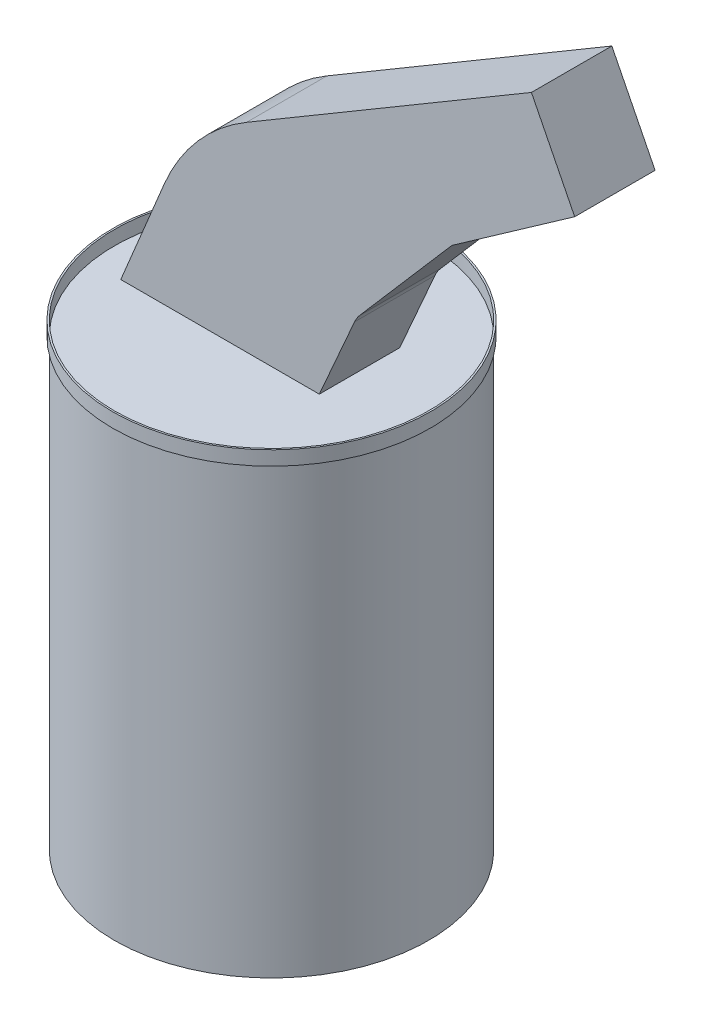
ISO-10303-21;
HEADER;
FILE_DESCRIPTION(('STEP AP214'),'2;1');
FILE_NAME('part.step','',(''),(''),'','','');
FILE_SCHEMA(('AUTOMOTIVE_DESIGN { 1 0 10303 214 1 1 1 1 }'));
ENDSEC;
DATA;
#1=APPLICATION_CONTEXT('core data for automotive mechanical design processes');
#2=APPLICATION_PROTOCOL_DEFINITION('international standard','automotive_design',2000,#1);
#3=PRODUCT_CONTEXT('',#1,'mechanical');
#4=PRODUCT('Part','Part','',(#3));
#5=PRODUCT_RELATED_PRODUCT_CATEGORY('part','',(#4));
#6=PRODUCT_DEFINITION_FORMATION('','',#4);
#7=PRODUCT_DEFINITION_CONTEXT('part definition',#1,'design');
#8=PRODUCT_DEFINITION('design','',#6,#7);
#9=PRODUCT_DEFINITION_SHAPE('','',#8);
#10=(LENGTH_UNIT() NAMED_UNIT(*) SI_UNIT(.MILLI.,.METRE.));
#11=(NAMED_UNIT(*) PLANE_ANGLE_UNIT() SI_UNIT($,.RADIAN.));
#12=(NAMED_UNIT(*) SI_UNIT($,.STERADIAN.) SOLID_ANGLE_UNIT());
#13=UNCERTAINTY_MEASURE_WITH_UNIT(LENGTH_MEASURE(1.E-05),#10,'distance_accuracy_value','');
#14=(GEOMETRIC_REPRESENTATION_CONTEXT(3) GLOBAL_UNCERTAINTY_ASSIGNED_CONTEXT((#13)) GLOBAL_UNIT_ASSIGNED_CONTEXT((#10,
#11,#12)) REPRESENTATION_CONTEXT('',''));
#15=CARTESIAN_POINT('',(0.,0.,0.));
#16=DIRECTION('',(0.,0.,1.));
#17=DIRECTION('',(1.,0.,0.));
#18=AXIS2_PLACEMENT_3D('',#15,#16,#17);
#19=CARTESIAN_POINT('',(46.4026965544984,91.6790408712856,12.15));
#20=DIRECTION('',(0.,0.,-1.));
#21=DIRECTION('',(-1.,0.,0.));
#22=AXIS2_PLACEMENT_3D('',#19,#20,#21);
#23=CYLINDRICAL_SURFACE('',#22,10.);
#24=CARTESIAN_POINT('',(46.4026965544984,91.6790408712856,-12.15));
#25=DIRECTION('',(0.,0.,-1.));
#26=DIRECTION('',(-1.,0.,0.));
#27=AXIS2_PLACEMENT_3D('',#24,#25,#26);
#28=CIRCLE('',#27,10.);
#29=CARTESIAN_POINT('',(37.2467300369342,95.7000204943678,-12.15));
#30=VERTEX_POINT('',#29);
#31=CARTESIAN_POINT('',(38.8362272029397,98.2172777553333,-12.15));
#32=VERTEX_POINT('',#31);
#33=EDGE_CURVE('E148',#30,#32,#28,.T.);
#34=ORIENTED_EDGE('',*,*,#33,.T.);
#35=DIRECTION('',(0.,0.,-1.));
#36=VECTOR('',#35,1.);
#37=CARTESIAN_POINT('',(38.8362272029397,98.2172777553333,12.15));
#38=LINE('',#37,#36);
#39=CARTESIAN_POINT('',(38.8362272029397,98.2172777553333,12.15));
#40=VERTEX_POINT('',#39);
#41=EDGE_CURVE('E12',#40,#32,#38,.T.);
#42=ORIENTED_EDGE('',*,*,#41,.F.);
#43=CARTESIAN_POINT('',(46.4026965544984,91.6790408712856,12.15));
#44=DIRECTION('',(0.,0.,-1.));
#45=DIRECTION('',(-1.,0.,0.));
#46=AXIS2_PLACEMENT_3D('',#43,#44,#45);
#47=CIRCLE('',#46,10.);
#48=CARTESIAN_POINT('',(37.2467300369342,95.7000204943678,12.15));
#49=VERTEX_POINT('',#48);
#50=EDGE_CURVE('E164',#49,#40,#47,.T.);
#51=ORIENTED_EDGE('',*,*,#50,.F.);
#52=DIRECTION('',(0.,0.,-1.));
#53=VECTOR('',#52,1.);
#54=CARTESIAN_POINT('',(37.2467300369342,95.7000204943678,12.15));
#55=LINE('',#54,#53);
#56=EDGE_CURVE('E144',#49,#30,#55,.T.);
#57=ORIENTED_EDGE('',*,*,#56,.T.);
#58=EDGE_LOOP('',(#34,#42,#51,#57));
#59=FACE_BOUND('',#58,.T.);
#60=ADVANCED_FACE('F46',(#59),#23,.F.);
#61=CARTESIAN_POINT('',(66.6539817342171,130.409777174197,12.15));
#62=DIRECTION('',(-0.756646935155878,0.653823688404769,0.));
#63=DIRECTION('',(-0.65382368840477,-0.756646935155878,0.));
#64=AXIS2_PLACEMENT_3D('',#61,#62,#63);
#65=PLANE('',#64);
#66=DIRECTION('',(0.653823688404769,0.756646935155878,0.));
#67=VECTOR('',#66,1.);
#68=CARTESIAN_POINT('',(66.6539817342171,130.409777174197,-12.15));
#69=LINE('',#68,#67);
#70=CARTESIAN_POINT('',(66.6539817342171,130.409777174197,-12.15));
#71=VERTEX_POINT('',#70);
#72=EDGE_CURVE('E151',#32,#71,#69,.T.);
#73=ORIENTED_EDGE('',*,*,#72,.T.);
#74=DIRECTION('',(0.,0.,-1.));
#75=VECTOR('',#74,1.);
#76=CARTESIAN_POINT('',(66.6539817342171,130.409777174197,12.15));
#77=LINE('',#76,#75);
#78=CARTESIAN_POINT('',(66.6539817342171,130.409777174197,12.15));
#79=VERTEX_POINT('',#78);
#80=EDGE_CURVE('E54',#79,#71,#77,.T.);
#81=ORIENTED_EDGE('',*,*,#80,.F.);
#82=DIRECTION('',(0.653823688404769,0.756646935155878,0.));
#83=VECTOR('',#82,1.);
#84=CARTESIAN_POINT('',(66.6539817342171,130.409777174197,12.15));
#85=LINE('',#84,#83);
#86=EDGE_CURVE('E108',#40,#79,#85,.T.);
#87=ORIENTED_EDGE('',*,*,#86,.F.);
#88=ORIENTED_EDGE('',*,*,#41,.T.);
#89=EDGE_LOOP('',(#73,#81,#87,#88));
#90=FACE_BOUND('',#89,.T.);
#91=ADVANCED_FACE('F207',(#90),#65,.F.);
#92=CARTESIAN_POINT('',(66.6539817342171,130.409777174197,12.15));
#93=DIRECTION('',(-0.574569426838052,0.818455847155479,0.));
#94=DIRECTION('',(-0.818455847155479,-0.574569426838052,0.));
#95=AXIS2_PLACEMENT_3D('',#92,#93,#94);
#96=PLANE('',#95);
#97=DIRECTION('',(0.818455847155479,0.574569426838052,0.));
#98=VECTOR('',#97,1.);
#99=CARTESIAN_POINT('',(66.6539817342171,130.409777174197,-12.15));
#100=LINE('',#99,#98);
#101=CARTESIAN_POINT('',(103.774602702842,156.469061847819,-12.15));
#102=VERTEX_POINT('',#101);
#103=EDGE_CURVE('E153',#71,#102,#100,.T.);
#104=ORIENTED_EDGE('',*,*,#103,.T.);
#105=DIRECTION('',(0.,0.,-1.));
#106=VECTOR('',#105,1.);
#107=CARTESIAN_POINT('',(103.774602702842,156.469061847819,12.15));
#108=LINE('',#107,#106);
#109=CARTESIAN_POINT('',(103.774602702842,156.469061847819,12.15));
#110=VERTEX_POINT('',#109);
#111=EDGE_CURVE('E174',#110,#102,#108,.T.);
#112=ORIENTED_EDGE('',*,*,#111,.F.);
#113=DIRECTION('',(0.818455847155479,0.574569426838052,0.));
#114=VECTOR('',#113,1.);
#115=CARTESIAN_POINT('',(66.6539817342171,130.409777174197,12.15));
#116=LINE('',#115,#114);
#117=EDGE_CURVE('E182',#79,#110,#116,.T.);
#118=ORIENTED_EDGE('',*,*,#117,.F.);
#119=ORIENTED_EDGE('',*,*,#80,.T.);
#120=EDGE_LOOP('',(#104,#112,#118,#119));
#121=FACE_BOUND('',#120,.T.);
#122=ADVANCED_FACE('F180',(#121),#96,.F.);
#123=CARTESIAN_POINT('',(103.774602702842,156.469061847819,12.15));
#124=DIRECTION('',(-0.893508762292376,-0.449045756807417,0.));
#125=DIRECTION('',(0.449045756807417,-0.893508762292376,0.));
#126=AXIS2_PLACEMENT_3D('',#123,#124,#125);
#127=PLANE('',#126);
#128=DIRECTION('',(-0.449045756807417,0.893508762292376,0.));
#129=VECTOR('',#128,1.);
#130=CARTESIAN_POINT('',(103.774602702842,156.469061847819,-12.15));
#131=LINE('',#130,#129);
#132=CARTESIAN_POINT('',(90.7045045958926,182.475870743217,-12.15));
#133=VERTEX_POINT('',#132);
#134=EDGE_CURVE('E155',#102,#133,#131,.T.);
#135=ORIENTED_EDGE('',*,*,#134,.T.);
#136=DIRECTION('',(0.,0.,-1.));
#137=VECTOR('',#136,1.);
#138=CARTESIAN_POINT('',(90.7045045958926,182.475870743217,12.15));
#139=LINE('',#138,#137);
#140=CARTESIAN_POINT('',(90.7045045958926,182.475870743217,12.15));
#141=VERTEX_POINT('',#140);
#142=EDGE_CURVE('E171',#141,#133,#139,.T.);
#143=ORIENTED_EDGE('',*,*,#142,.F.);
#144=DIRECTION('',(-0.449045756807417,0.893508762292376,0.));
#145=VECTOR('',#144,1.);
#146=CARTESIAN_POINT('',(103.774602702842,156.469061847819,12.15));
#147=LINE('',#146,#145);
#148=EDGE_CURVE('E198',#110,#141,#147,.T.);
#149=ORIENTED_EDGE('',*,*,#148,.F.);
#150=ORIENTED_EDGE('',*,*,#111,.T.);
#151=EDGE_LOOP('',(#135,#143,#149,#150));
#152=FACE_BOUND('',#151,.T.);
#153=ADVANCED_FACE('F191',(#152),#127,.F.);
#154=CARTESIAN_POINT('',(90.7045045958926,182.475870743217,12.15));
#155=DIRECTION('',(0.508666245283803,-0.86096379186867,0.));
#156=DIRECTION('',(0.86096379186867,0.508666245283803,0.));
#157=AXIS2_PLACEMENT_3D('',#154,#155,#156);
#158=PLANE('',#157);
#159=DIRECTION('',(-0.86096379186867,-0.508666245283803,0.));
#160=VECTOR('',#159,1.);
#161=CARTESIAN_POINT('',(90.7045045958926,182.475870743217,-12.15));
#162=LINE('',#161,#160);
#163=CARTESIAN_POINT('',(4.60812540902562,131.609246214837,-12.15));
#164=VERTEX_POINT('',#163);
#165=EDGE_CURVE('E157',#133,#164,#162,.T.);
#166=ORIENTED_EDGE('',*,*,#165,.T.);
#167=DIRECTION('',(0.,0.,-1.));
#168=VECTOR('',#167,1.);
#169=CARTESIAN_POINT('',(4.60812540902562,131.609246214837,12.15));
#170=LINE('',#169,#168);
#171=CARTESIAN_POINT('',(4.60812540902562,131.609246214837,12.15));
#172=VERTEX_POINT('',#171);
#173=EDGE_CURVE('E168',#172,#164,#170,.T.);
#174=ORIENTED_EDGE('',*,*,#173,.F.);
#175=DIRECTION('',(-0.86096379186867,-0.508666245283803,0.));
#176=VECTOR('',#175,1.);
#177=CARTESIAN_POINT('',(90.7045045958926,182.475870743217,12.15));
#178=LINE('',#177,#176);
#179=EDGE_CURVE('E197',#141,#172,#178,.T.);
#180=ORIENTED_EDGE('',*,*,#179,.F.);
#181=ORIENTED_EDGE('',*,*,#142,.T.);
#182=EDGE_LOOP('',(#166,#174,#180,#181));
#183=FACE_BOUND('',#182,.T.);
#184=ADVANCED_FACE('F195',(#183),#158,.F.);
#185=CARTESIAN_POINT('',(35.1281001260537,79.9514187027167,12.15));
#186=DIRECTION('',(0.,0.,-1.));
#187=DIRECTION('',(-1.,0.,0.));
#188=AXIS2_PLACEMENT_3D('',#185,#186,#187);
#189=CYLINDRICAL_SURFACE('',#188,60.);
#190=CARTESIAN_POINT('',(35.1281001260537,79.9514187027167,-12.15));
#191=DIRECTION('',(0.,0.,1.));
#192=DIRECTION('',(1.,0.,0.));
#193=AXIS2_PLACEMENT_3D('',#190,#191,#192);
#194=CIRCLE('',#193,60.);
#195=CARTESIAN_POINT('',(-20.2634449671667,103.011703440459,-12.15));
#196=VERTEX_POINT('',#195);
#197=EDGE_CURVE('E159',#164,#196,#194,.T.);
#198=ORIENTED_EDGE('',*,*,#197,.T.);
#199=DIRECTION('',(0.,0.,-1.));
#200=VECTOR('',#199,1.);
#201=CARTESIAN_POINT('',(-20.2634449671667,103.011703440459,12.15));
#202=LINE('',#201,#200);
#203=CARTESIAN_POINT('',(-20.2634449671667,103.011703440459,12.15));
#204=VERTEX_POINT('',#203);
#205=EDGE_CURVE('E139',#204,#196,#202,.T.);
#206=ORIENTED_EDGE('',*,*,#205,.F.);
#207=CARTESIAN_POINT('',(35.1281001260537,79.9514187027167,12.15));
#208=DIRECTION('',(0.,0.,1.));
#209=DIRECTION('',(1.,0.,0.));
#210=AXIS2_PLACEMENT_3D('',#207,#208,#209);
#211=CIRCLE('',#210,60.);
#212=EDGE_CURVE('E130',#172,#204,#211,.T.);
#213=ORIENTED_EDGE('',*,*,#212,.F.);
#214=ORIENTED_EDGE('',*,*,#173,.T.);
#215=EDGE_LOOP('',(#198,#206,#213,#214));
#216=FACE_BOUND('',#215,.T.);
#217=ADVANCED_FACE('F219',(#216),#189,.T.);
#218=CARTESIAN_POINT('',(-20.2634449671667,103.011703440459,12.15));
#219=DIRECTION('',(0.92319241822034,-0.384338078962365,0.));
#220=DIRECTION('',(0.384338078962365,0.92319241822034,0.));
#221=AXIS2_PLACEMENT_3D('',#218,#219,#220);
#222=PLANE('',#221);
#223=DIRECTION('',(-0.384338078962365,-0.92319241822034,0.));
#224=VECTOR('',#223,1.);
#225=CARTESIAN_POINT('',(-20.2634449671667,103.011703440459,-12.15));
#226=LINE('',#225,#224);
#227=CARTESIAN_POINT('',(-33.4030291206737,71.45,-12.15));
#228=VERTEX_POINT('',#227);
#229=EDGE_CURVE('E138',#196,#228,#226,.T.);
#230=ORIENTED_EDGE('',*,*,#229,.T.);
#231=DIRECTION('',(0.,0.,-1.));
#232=VECTOR('',#231,1.);
#233=CARTESIAN_POINT('',(-33.4030291206737,71.45,12.15));
#234=LINE('',#233,#232);
#235=CARTESIAN_POINT('',(-33.4030291206737,71.45,12.15));
#236=VERTEX_POINT('',#235);
#237=EDGE_CURVE('E135',#236,#228,#234,.T.);
#238=ORIENTED_EDGE('',*,*,#237,.F.);
#239=DIRECTION('',(-0.384338078962365,-0.92319241822034,0.));
#240=VECTOR('',#239,1.);
#241=CARTESIAN_POINT('',(-20.2634449671667,103.011703440459,12.15));
#242=LINE('',#241,#240);
#243=EDGE_CURVE('E124',#204,#236,#242,.T.);
#244=ORIENTED_EDGE('',*,*,#243,.F.);
#245=ORIENTED_EDGE('',*,*,#205,.T.);
#246=EDGE_LOOP('',(#230,#238,#244,#245));
#247=FACE_BOUND('',#246,.T.);
#248=ADVANCED_FACE('F136',(#247),#222,.F.);
#249=CARTESIAN_POINT('',(-33.4030291206737,71.45,12.15));
#250=DIRECTION('',(0.,1.,0.));
#251=DIRECTION('',(0.,0.,1.));
#252=AXIS2_PLACEMENT_3D('',#249,#250,#251);
#253=PLANE('',#252);
#254=DIRECTION('',(1.,0.,0.));
#255=VECTOR('',#254,1.);
#256=CARTESIAN_POINT('',(-33.4030291206737,71.45,-12.15));
#257=LINE('',#256,#255);
#258=CARTESIAN_POINT('',(26.5969708793263,71.45,-12.15));
#259=VERTEX_POINT('',#258);
#260=EDGE_CURVE('E94',#228,#259,#257,.T.);
#261=ORIENTED_EDGE('',*,*,#260,.T.);
#262=DIRECTION('',(0.,0.,-1.));
#263=VECTOR('',#262,1.);
#264=CARTESIAN_POINT('',(26.5969708793263,71.45,12.15));
#265=LINE('',#264,#263);
#266=CARTESIAN_POINT('',(26.5969708793263,71.45,12.15));
#267=VERTEX_POINT('',#266);
#268=EDGE_CURVE('E140',#267,#259,#265,.T.);
#269=ORIENTED_EDGE('',*,*,#268,.F.);
#270=DIRECTION('',(1.,0.,0.));
#271=VECTOR('',#270,1.);
#272=CARTESIAN_POINT('',(-33.4030291206737,71.45,12.15));
#273=LINE('',#272,#271);
#274=EDGE_CURVE('E128',#236,#267,#273,.T.);
#275=ORIENTED_EDGE('',*,*,#274,.F.);
#276=ORIENTED_EDGE('',*,*,#237,.T.);
#277=EDGE_LOOP('',(#261,#269,#275,#276));
#278=FACE_BOUND('',#277,.T.);
#279=ADVANCED_FACE('F142',(#278),#253,.F.);
#280=CARTESIAN_POINT('',(26.5969708793263,71.45,12.15));
#281=DIRECTION('',(-0.915596651756422,0.402097962308227,0.));
#282=DIRECTION('',(-0.402097962308227,-0.915596651756422,0.));
#283=AXIS2_PLACEMENT_3D('',#280,#281,#282);
#284=PLANE('',#283);
#285=DIRECTION('',(0.402097962308227,0.915596651756422,0.));
#286=VECTOR('',#285,1.);
#287=CARTESIAN_POINT('',(26.5969708793263,71.45,-12.15));
#288=LINE('',#287,#286);
#289=EDGE_CURVE('E100',#259,#30,#288,.T.);
#290=ORIENTED_EDGE('',*,*,#289,.T.);
#291=ORIENTED_EDGE('',*,*,#56,.F.);
#292=DIRECTION('',(0.402097962308227,0.915596651756422,0.));
#293=VECTOR('',#292,1.);
#294=CARTESIAN_POINT('',(26.5969708793263,71.45,12.15));
#295=LINE('',#294,#293);
#296=EDGE_CURVE('E62',#267,#49,#295,.T.);
#297=ORIENTED_EDGE('',*,*,#296,.F.);
#298=ORIENTED_EDGE('',*,*,#268,.T.);
#299=EDGE_LOOP('',(#290,#291,#297,#298));
#300=FACE_BOUND('',#299,.T.);
#301=ADVANCED_FACE('F227',(#300),#284,.F.);
#302=CARTESIAN_POINT('',(46.4026965544984,91.6790408712856,12.15));
#303=DIRECTION('',(0.,0.,-1.));
#304=DIRECTION('',(-1.,0.,0.));
#305=AXIS2_PLACEMENT_3D('',#302,#303,#304);
#306=PLANE('',#305);
#307=ORIENTED_EDGE('',*,*,#50,.T.);
#308=ORIENTED_EDGE('',*,*,#86,.T.);
#309=ORIENTED_EDGE('',*,*,#117,.T.);
#310=ORIENTED_EDGE('',*,*,#148,.T.);
#311=ORIENTED_EDGE('',*,*,#179,.T.);
#312=ORIENTED_EDGE('',*,*,#212,.T.);
#313=ORIENTED_EDGE('',*,*,#243,.T.);
#314=ORIENTED_EDGE('',*,*,#274,.T.);
#315=ORIENTED_EDGE('',*,*,#296,.T.);
#316=EDGE_LOOP('',(#307,#308,#309,#310,#311,#312,#313,#314,#315));
#317=FACE_BOUND('',#316,.T.);
#318=ADVANCED_FACE('F126',(#317),#306,.F.);
#319=CARTESIAN_POINT('',(46.4026965544984,91.6790408712856,-12.15));
#320=DIRECTION('',(0.,0.,-1.));
#321=DIRECTION('',(-1.,0.,0.));
#322=AXIS2_PLACEMENT_3D('',#319,#320,#321);
#323=PLANE('',#322);
#324=ORIENTED_EDGE('',*,*,#33,.F.);
#325=ORIENTED_EDGE('',*,*,#289,.F.);
#326=ORIENTED_EDGE('',*,*,#260,.F.);
#327=ORIENTED_EDGE('',*,*,#229,.F.);
#328=ORIENTED_EDGE('',*,*,#197,.F.);
#329=ORIENTED_EDGE('',*,*,#165,.F.);
#330=ORIENTED_EDGE('',*,*,#134,.F.);
#331=ORIENTED_EDGE('',*,*,#103,.F.);
#332=ORIENTED_EDGE('',*,*,#72,.F.);
#333=EDGE_LOOP('',(#324,#325,#326,#327,#328,#329,#330,#331,#332));
#334=FACE_BOUND('',#333,.T.);
#335=ADVANCED_FACE('F186',(#334),#323,.T.);
#336=CLOSED_SHELL('',(#60,#91,#122,#153,#184,#217,#248,#279,#301,#318,#335));
#337=MANIFOLD_SOLID_BREP('B2',#336);
#338=CARTESIAN_POINT('',(0.,71.45,0.));
#339=DIRECTION('',(0.,1.,0.));
#340=DIRECTION('',(0.,0.,1.));
#341=AXIS2_PLACEMENT_3D('',#338,#339,#340);
#342=PLANE('',#341);
#343=CARTESIAN_POINT('',(0.,71.45,0.));
#344=DIRECTION('',(0.,1.,0.));
#345=DIRECTION('',(0.,0.,1.));
#346=AXIS2_PLACEMENT_3D('',#343,#344,#345);
#347=CIRCLE('',#346,48.);
#348=CARTESIAN_POINT('',(0.,71.45,48.));
#349=VERTEX_POINT('',#348);
#350=EDGE_CURVE('E45',#349,#349,#347,.T.);
#351=ORIENTED_EDGE('',*,*,#350,.T.);
#352=EDGE_LOOP('',(#351));
#353=FACE_BOUND('',#352,.T.);
#354=CARTESIAN_POINT('',(0.,71.45,0.));
#355=DIRECTION('',(0.,1.,0.));
#356=DIRECTION('',(0.,0.,1.));
#357=AXIS2_PLACEMENT_3D('',#354,#355,#356);
#358=CIRCLE('',#357,47.5);
#359=CARTESIAN_POINT('',(0.,71.45,47.5));
#360=VERTEX_POINT('',#359);
#361=EDGE_CURVE('E318',#360,#360,#358,.T.);
#362=ORIENTED_EDGE('',*,*,#361,.F.);
#363=EDGE_LOOP('',(#362));
#364=FACE_BOUND('',#363,.T.);
#365=ADVANCED_FACE('F307',(#353,#364),#342,.T.);
#366=CARTESIAN_POINT('',(0.,67.15,0.));
#367=DIRECTION('',(0.,1.,0.));
#368=DIRECTION('',(0.,0.,1.));
#369=AXIS2_PLACEMENT_3D('',#366,#367,#368);
#370=PLANE('',#369);
#371=CARTESIAN_POINT('',(0.,67.15,0.));
#372=DIRECTION('',(0.,1.,0.));
#373=DIRECTION('',(0.,0.,1.));
#374=AXIS2_PLACEMENT_3D('',#371,#372,#373);
#375=CIRCLE('',#374,48.);
#376=CARTESIAN_POINT('',(0.,67.15,48.));
#377=VERTEX_POINT('',#376);
#378=EDGE_CURVE('E311',#377,#377,#375,.T.);
#379=ORIENTED_EDGE('',*,*,#378,.F.);
#380=EDGE_LOOP('',(#379));
#381=FACE_BOUND('',#380,.T.);
#382=CARTESIAN_POINT('',(0.,67.15,0.));
#383=DIRECTION('',(0.,1.,0.));
#384=DIRECTION('',(0.,0.,1.));
#385=AXIS2_PLACEMENT_3D('',#382,#383,#384);
#386=CIRCLE('',#385,47.5);
#387=CARTESIAN_POINT('',(0.,67.15,47.5));
#388=VERTEX_POINT('',#387);
#389=EDGE_CURVE('E320',#388,#388,#386,.T.);
#390=ORIENTED_EDGE('',*,*,#389,.T.);
#391=EDGE_LOOP('',(#390));
#392=FACE_BOUND('',#391,.T.);
#393=ADVANCED_FACE('F330',(#381,#392),#370,.F.);
#394=CARTESIAN_POINT('',(0.,71.45,0.));
#395=DIRECTION('',(0.,-1.,0.));
#396=DIRECTION('',(0.,0.,-1.));
#397=AXIS2_PLACEMENT_3D('',#394,#395,#396);
#398=CYLINDRICAL_SURFACE('',#397,48.);
#399=ORIENTED_EDGE('',*,*,#350,.F.);
#400=EDGE_LOOP('',(#399));
#401=FACE_BOUND('',#400,.T.);
#402=ORIENTED_EDGE('',*,*,#378,.T.);
#403=EDGE_LOOP('',(#402));
#404=FACE_BOUND('',#403,.T.);
#405=ADVANCED_FACE('F309',(#401,#404),#398,.T.);
#406=CARTESIAN_POINT('',(0.,71.45,0.));
#407=DIRECTION('',(0.,-1.,0.));
#408=DIRECTION('',(0.,0.,-1.));
#409=AXIS2_PLACEMENT_3D('',#406,#407,#408);
#410=CYLINDRICAL_SURFACE('',#409,47.5);
#411=ORIENTED_EDGE('',*,*,#361,.T.);
#412=EDGE_LOOP('',(#411));
#413=FACE_BOUND('',#412,.T.);
#414=ORIENTED_EDGE('',*,*,#389,.F.);
#415=EDGE_LOOP('',(#414));
#416=FACE_BOUND('',#415,.T.);
#417=ADVANCED_FACE('F326',(#413,#416),#410,.F.);
#418=CLOSED_SHELL('',(#365,#393,#405,#417));
#419=MANIFOLD_SOLID_BREP('B6',#418);
#420=CARTESIAN_POINT('',(0.,67.15,0.));
#421=DIRECTION('',(0.,-1.,0.));
#422=DIRECTION('',(0.,0.,-1.));
#423=AXIS2_PLACEMENT_3D('',#420,#421,#422);
#424=CYLINDRICAL_SURFACE('',#423,47.5);
#425=CARTESIAN_POINT('',(0.,67.15,0.));
#426=DIRECTION('',(0.,1.,0.));
#427=DIRECTION('',(0.,0.,1.));
#428=AXIS2_PLACEMENT_3D('',#425,#426,#427);
#429=CIRCLE('',#428,47.5);
#430=CARTESIAN_POINT('',(0.,67.15,47.5));
#431=VERTEX_POINT('',#430);
#432=EDGE_CURVE('E306',#431,#431,#429,.T.);
#433=ORIENTED_EDGE('',*,*,#432,.F.);
#434=EDGE_LOOP('',(#433));
#435=FACE_BOUND('',#434,.T.);
#436=CARTESIAN_POINT('',(0.,-67.15,0.));
#437=DIRECTION('',(0.,1.,0.));
#438=DIRECTION('',(0.,0.,1.));
#439=AXIS2_PLACEMENT_3D('',#436,#437,#438);
#440=CIRCLE('',#439,47.5);
#441=CARTESIAN_POINT('',(0.,-67.15,47.5));
#442=VERTEX_POINT('',#441);
#443=EDGE_CURVE('E372',#442,#442,#440,.T.);
#444=ORIENTED_EDGE('',*,*,#443,.T.);
#445=EDGE_LOOP('',(#444));
#446=FACE_BOUND('',#445,.T.);
#447=ADVANCED_FACE('F369',(#435,#446),#424,.T.);
#448=CARTESIAN_POINT('',(0.,67.15,0.));
#449=DIRECTION('',(0.,1.,0.));
#450=DIRECTION('',(0.,0.,1.));
#451=AXIS2_PLACEMENT_3D('',#448,#449,#450);
#452=PLANE('',#451);
#453=ORIENTED_EDGE('',*,*,#432,.T.);
#454=EDGE_LOOP('',(#453));
#455=FACE_BOUND('',#454,.T.);
#456=ADVANCED_FACE('F384',(#455),#452,.T.);
#457=CARTESIAN_POINT('',(0.,-67.15,0.));
#458=DIRECTION('',(0.,1.,0.));
#459=DIRECTION('',(0.,0.,1.));
#460=AXIS2_PLACEMENT_3D('',#457,#458,#459);
#461=PLANE('',#460);
#462=ORIENTED_EDGE('',*,*,#443,.F.);
#463=EDGE_LOOP('',(#462));
#464=FACE_BOUND('',#463,.T.);
#465=ADVANCED_FACE('F382',(#464),#461,.F.);
#466=CLOSED_SHELL('',(#447,#456,#465));
#467=MANIFOLD_SOLID_BREP('B40',#466);
#468=ADVANCED_BREP_SHAPE_REPRESENTATION('',(#18,#337,#419,#467),#14);
#469=SHAPE_DEFINITION_REPRESENTATION(#9,#468);
ENDSEC;
END-ISO-10303-21;
